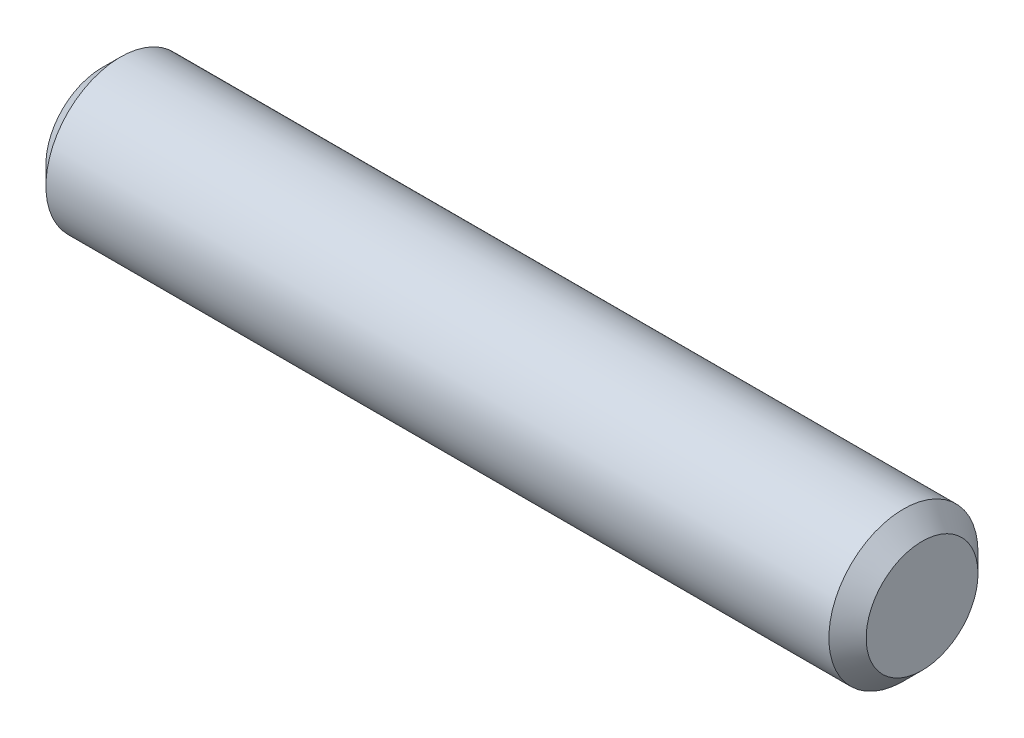
ISO-10303-21;
HEADER;
FILE_DESCRIPTION(('STEP AP214'),'2;1');
FILE_NAME('part.step','',(''),(''),'','','');
FILE_SCHEMA(('AUTOMOTIVE_DESIGN { 1 0 10303 214 1 1 1 1 }'));
ENDSEC;
DATA;
#1=APPLICATION_CONTEXT('core data for automotive mechanical design processes');
#2=APPLICATION_PROTOCOL_DEFINITION('international standard','automotive_design',2000,#1);
#3=PRODUCT_CONTEXT('',#1,'mechanical');
#4=PRODUCT('Part','Part','',(#3));
#5=PRODUCT_RELATED_PRODUCT_CATEGORY('part','',(#4));
#6=PRODUCT_DEFINITION_FORMATION('','',#4);
#7=PRODUCT_DEFINITION_CONTEXT('part definition',#1,'design');
#8=PRODUCT_DEFINITION('design','',#6,#7);
#9=PRODUCT_DEFINITION_SHAPE('','',#8);
#10=(LENGTH_UNIT() NAMED_UNIT(*) SI_UNIT(.MILLI.,.METRE.));
#11=(NAMED_UNIT(*) PLANE_ANGLE_UNIT() SI_UNIT($,.RADIAN.));
#12=(NAMED_UNIT(*) SI_UNIT($,.STERADIAN.) SOLID_ANGLE_UNIT());
#13=UNCERTAINTY_MEASURE_WITH_UNIT(LENGTH_MEASURE(1.E-05),#10,'distance_accuracy_value','');
#14=(GEOMETRIC_REPRESENTATION_CONTEXT(3) GLOBAL_UNCERTAINTY_ASSIGNED_CONTEXT((#13)) GLOBAL_UNIT_ASSIGNED_CONTEXT((#10,
#11,#12)) REPRESENTATION_CONTEXT('',''));
#15=CARTESIAN_POINT('',(0.,0.,0.));
#16=DIRECTION('',(0.,0.,1.));
#17=DIRECTION('',(1.,0.,0.));
#18=AXIS2_PLACEMENT_3D('',#15,#16,#17);
#19=CARTESIAN_POINT('',(11.,0.,0.));
#20=DIRECTION('',(-1.,0.,0.));
#21=DIRECTION('',(0.,0.,1.));
#22=AXIS2_PLACEMENT_3D('',#19,#20,#21);
#23=CYLINDRICAL_SURFACE('',#22,2.);
#24=CARTESIAN_POINT('',(10.5,0.,0.));
#25=DIRECTION('',(1.,0.,0.));
#26=DIRECTION('',(0.,0.,-1.));
#27=AXIS2_PLACEMENT_3D('',#24,#25,#26);
#28=CIRCLE('',#27,2.);
#29=CARTESIAN_POINT('',(10.5,0.,-2.));
#30=VERTEX_POINT('',#29);
#31=EDGE_CURVE('E45',#30,#30,#28,.F.);
#32=ORIENTED_EDGE('',*,*,#31,.T.);
#33=EDGE_LOOP('',(#32));
#34=FACE_BOUND('',#33,.T.);
#35=CARTESIAN_POINT('',(-10.5,0.,0.));
#36=DIRECTION('',(1.,0.,0.));
#37=DIRECTION('',(0.,0.,-1.));
#38=AXIS2_PLACEMENT_3D('',#35,#36,#37);
#39=CIRCLE('',#38,2.);
#40=CARTESIAN_POINT('',(-10.5,0.,-2.));
#41=VERTEX_POINT('',#40);
#42=EDGE_CURVE('E50',#41,#41,#39,.T.);
#43=ORIENTED_EDGE('',*,*,#42,.T.);
#44=EDGE_LOOP('',(#43));
#45=FACE_BOUND('',#44,.T.);
#46=ADVANCED_FACE('F37',(#34,#45),#23,.T.);
#47=CARTESIAN_POINT('',(11.,0.,0.));
#48=DIRECTION('',(1.,0.,0.));
#49=DIRECTION('',(0.,0.,-1.));
#50=AXIS2_PLACEMENT_3D('',#47,#48,#49);
#51=PLANE('',#50);
#52=CARTESIAN_POINT('',(11.,0.,0.));
#53=DIRECTION('',(1.,0.,0.));
#54=DIRECTION('',(0.,0.,-1.));
#55=AXIS2_PLACEMENT_3D('',#52,#53,#54);
#56=CIRCLE('',#55,1.5);
#57=CARTESIAN_POINT('',(11.,0.,-1.5));
#58=VERTEX_POINT('',#57);
#59=EDGE_CURVE('E55',#58,#58,#56,.T.);
#60=ORIENTED_EDGE('',*,*,#59,.T.);
#61=EDGE_LOOP('',(#60));
#62=FACE_BOUND('',#61,.T.);
#63=ADVANCED_FACE('F62',(#62),#51,.T.);
#64=CARTESIAN_POINT('',(-11.,0.,0.));
#65=DIRECTION('',(1.,0.,0.));
#66=DIRECTION('',(0.,0.,-1.));
#67=AXIS2_PLACEMENT_3D('',#64,#65,#66);
#68=PLANE('',#67);
#69=CARTESIAN_POINT('',(-11.,0.,0.));
#70=DIRECTION('',(1.,0.,0.));
#71=DIRECTION('',(0.,0.,-1.));
#72=AXIS2_PLACEMENT_3D('',#69,#70,#71);
#73=CIRCLE('',#72,1.5);
#74=CARTESIAN_POINT('',(-11.,0.,-1.5));
#75=VERTEX_POINT('',#74);
#76=EDGE_CURVE('E10',#75,#75,#73,.F.);
#77=ORIENTED_EDGE('',*,*,#76,.T.);
#78=EDGE_LOOP('',(#77));
#79=FACE_BOUND('',#78,.T.);
#80=ADVANCED_FACE('F66',(#79),#68,.F.);
#81=CARTESIAN_POINT('',(11.,0.,0.));
#82=DIRECTION('',(-1.,0.,0.));
#83=DIRECTION('',(0.,0.,1.));
#84=AXIS2_PLACEMENT_3D('',#81,#82,#83);
#85=CONICAL_SURFACE('',#84,1.5,0.785398163397445);
#86=ORIENTED_EDGE('',*,*,#31,.F.);
#87=EDGE_LOOP('',(#86));
#88=FACE_BOUND('',#87,.T.);
#89=ORIENTED_EDGE('',*,*,#59,.F.);
#90=EDGE_LOOP('',(#89));
#91=FACE_BOUND('',#90,.T.);
#92=ADVANCED_FACE('F64',(#88,#91),#85,.T.);
#93=CARTESIAN_POINT('',(-10.5,0.,0.));
#94=DIRECTION('',(1.,0.,0.));
#95=DIRECTION('',(0.,0.,-1.));
#96=AXIS2_PLACEMENT_3D('',#93,#94,#95);
#97=CONICAL_SURFACE('',#96,2.,0.78539816339745);
#98=ORIENTED_EDGE('',*,*,#76,.F.);
#99=EDGE_LOOP('',(#98));
#100=FACE_BOUND('',#99,.T.);
#101=ORIENTED_EDGE('',*,*,#42,.F.);
#102=EDGE_LOOP('',(#101));
#103=FACE_BOUND('',#102,.T.);
#104=ADVANCED_FACE('F39',(#100,#103),#97,.T.);
#105=CLOSED_SHELL('',(#46,#63,#80,#92,#104));
#106=MANIFOLD_SOLID_BREP('B2',#105);
#107=ADVANCED_BREP_SHAPE_REPRESENTATION('',(#18,#106),#14);
#108=SHAPE_DEFINITION_REPRESENTATION(#9,#107);
ENDSEC;
END-ISO-10303-21;
